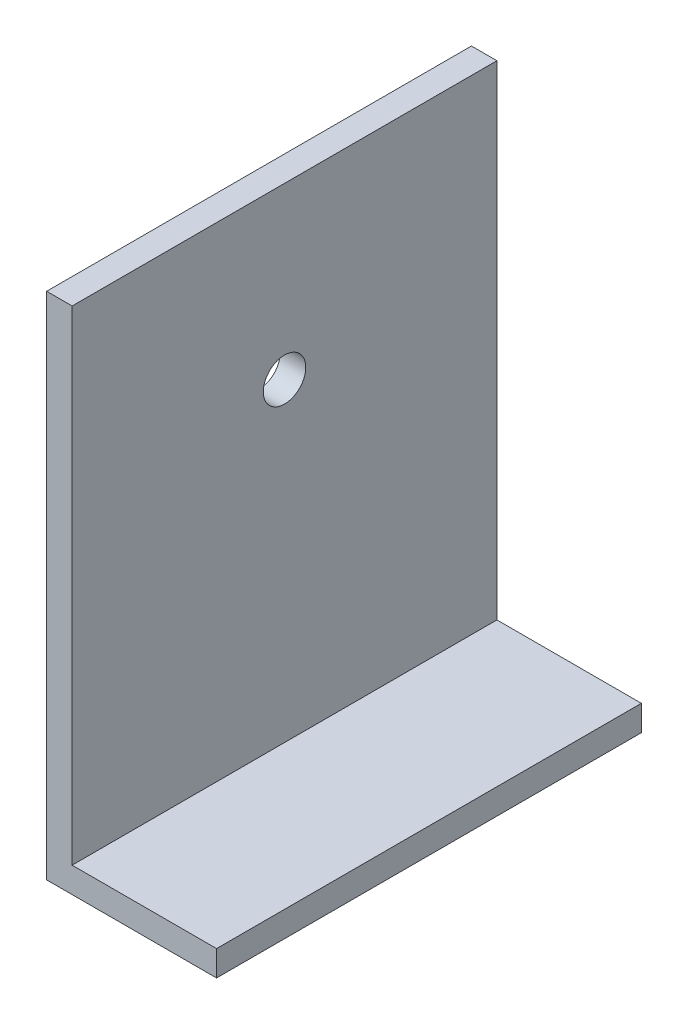
ISO-10303-21;
HEADER;
FILE_DESCRIPTION(('STEP AP214'),'2;1');
FILE_NAME('part.step','',(''),(''),'','','');
FILE_SCHEMA(('AUTOMOTIVE_DESIGN { 1 0 10303 214 1 1 1 1 }'));
ENDSEC;
DATA;
#1=APPLICATION_CONTEXT('core data for automotive mechanical design processes');
#2=APPLICATION_PROTOCOL_DEFINITION('international standard','automotive_design',2000,#1);
#3=PRODUCT_CONTEXT('',#1,'mechanical');
#4=PRODUCT('Part','Part','',(#3));
#5=PRODUCT_RELATED_PRODUCT_CATEGORY('part','',(#4));
#6=PRODUCT_DEFINITION_FORMATION('','',#4);
#7=PRODUCT_DEFINITION_CONTEXT('part definition',#1,'design');
#8=PRODUCT_DEFINITION('design','',#6,#7);
#9=PRODUCT_DEFINITION_SHAPE('','',#8);
#10=(LENGTH_UNIT() NAMED_UNIT(*) SI_UNIT(.MILLI.,.METRE.));
#11=(NAMED_UNIT(*) PLANE_ANGLE_UNIT() SI_UNIT($,.RADIAN.));
#12=(NAMED_UNIT(*) SI_UNIT($,.STERADIAN.) SOLID_ANGLE_UNIT());
#13=UNCERTAINTY_MEASURE_WITH_UNIT(LENGTH_MEASURE(1.E-05),#10,'distance_accuracy_value','');
#14=(GEOMETRIC_REPRESENTATION_CONTEXT(3) GLOBAL_UNCERTAINTY_ASSIGNED_CONTEXT((#13)) GLOBAL_UNIT_ASSIGNED_CONTEXT((#10,
#11,#12)) REPRESENTATION_CONTEXT('',''));
#15=CARTESIAN_POINT('',(0.,0.,0.));
#16=DIRECTION('',(0.,0.,1.));
#17=DIRECTION('',(1.,0.,0.));
#18=AXIS2_PLACEMENT_3D('',#15,#16,#17);
#19=CARTESIAN_POINT('',(0.,0.,50.));
#20=DIRECTION('',(1.,0.,0.));
#21=DIRECTION('',(0.,0.,-1.));
#22=AXIS2_PLACEMENT_3D('',#19,#20,#21);
#23=PLANE('',#22);
#24=CARTESIAN_POINT('',(0.,40.,25.));
#25=DIRECTION('',(-1.,0.,0.));
#26=DIRECTION('',(0.,0.,1.));
#27=AXIS2_PLACEMENT_3D('',#24,#25,#26);
#28=CIRCLE('',#27,2.5);
#29=CARTESIAN_POINT('',(0.,40.,27.5));
#30=VERTEX_POINT('',#29);
#31=EDGE_CURVE('E163',#30,#30,#28,.T.);
#32=ORIENTED_EDGE('',*,*,#31,.F.);
#33=EDGE_LOOP('',(#32));
#34=FACE_BOUND('',#33,.T.);
#35=DIRECTION('',(0.,-1.,0.));
#36=VECTOR('',#35,1.);
#37=CARTESIAN_POINT('',(0.,0.,0.));
#38=LINE('',#37,#36);
#39=CARTESIAN_POINT('',(0.,60.,0.));
#40=VERTEX_POINT('',#39);
#41=CARTESIAN_POINT('',(0.,0.,0.));
#42=VERTEX_POINT('',#41);
#43=EDGE_CURVE('E118',#40,#42,#38,.T.);
#44=ORIENTED_EDGE('',*,*,#43,.T.);
#45=DIRECTION('',(0.,0.,-1.));
#46=VECTOR('',#45,1.);
#47=CARTESIAN_POINT('',(0.,0.,50.));
#48=LINE('',#47,#46);
#49=CARTESIAN_POINT('',(0.,0.,50.));
#50=VERTEX_POINT('',#49);
#51=EDGE_CURVE('E11',#50,#42,#48,.T.);
#52=ORIENTED_EDGE('',*,*,#51,.F.);
#53=DIRECTION('',(0.,-1.,0.));
#54=VECTOR('',#53,1.);
#55=CARTESIAN_POINT('',(0.,0.,50.));
#56=LINE('',#55,#54);
#57=CARTESIAN_POINT('',(0.,60.,50.));
#58=VERTEX_POINT('',#57);
#59=EDGE_CURVE('E128',#58,#50,#56,.T.);
#60=ORIENTED_EDGE('',*,*,#59,.F.);
#61=DIRECTION('',(0.,0.,-1.));
#62=VECTOR('',#61,1.);
#63=CARTESIAN_POINT('',(0.,60.,50.));
#64=LINE('',#63,#62);
#65=EDGE_CURVE('E114',#58,#40,#64,.T.);
#66=ORIENTED_EDGE('',*,*,#65,.T.);
#67=EDGE_LOOP('',(#44,#52,#60,#66));
#68=FACE_BOUND('',#67,.T.);
#69=ADVANCED_FACE('F33',(#34,#68),#23,.F.);
#70=CARTESIAN_POINT('',(0.,0.,50.));
#71=DIRECTION('',(0.,1.,0.));
#72=DIRECTION('',(0.,0.,1.));
#73=AXIS2_PLACEMENT_3D('',#70,#71,#72);
#74=PLANE('',#73);
#75=DIRECTION('',(1.,0.,0.));
#76=VECTOR('',#75,1.);
#77=CARTESIAN_POINT('',(0.,0.,0.));
#78=LINE('',#77,#76);
#79=CARTESIAN_POINT('',(20.,0.,0.));
#80=VERTEX_POINT('',#79);
#81=EDGE_CURVE('E121',#42,#80,#78,.T.);
#82=ORIENTED_EDGE('',*,*,#81,.T.);
#83=DIRECTION('',(0.,0.,-1.));
#84=VECTOR('',#83,1.);
#85=CARTESIAN_POINT('',(20.,0.,50.));
#86=LINE('',#85,#84);
#87=CARTESIAN_POINT('',(20.,0.,50.));
#88=VERTEX_POINT('',#87);
#89=EDGE_CURVE('E42',#88,#80,#86,.T.);
#90=ORIENTED_EDGE('',*,*,#89,.F.);
#91=DIRECTION('',(1.,0.,0.));
#92=VECTOR('',#91,1.);
#93=CARTESIAN_POINT('',(0.,0.,50.));
#94=LINE('',#93,#92);
#95=EDGE_CURVE('E87',#50,#88,#94,.T.);
#96=ORIENTED_EDGE('',*,*,#95,.F.);
#97=ORIENTED_EDGE('',*,*,#51,.T.);
#98=EDGE_LOOP('',(#82,#90,#96,#97));
#99=FACE_BOUND('',#98,.T.);
#100=ADVANCED_FACE('F155',(#99),#74,.F.);
#101=CARTESIAN_POINT('',(20.,0.,50.));
#102=DIRECTION('',(-1.,0.,0.));
#103=DIRECTION('',(0.,-1.,0.));
#104=AXIS2_PLACEMENT_3D('',#101,#102,#103);
#105=PLANE('',#104);
#106=DIRECTION('',(0.,1.,0.));
#107=VECTOR('',#106,1.);
#108=CARTESIAN_POINT('',(20.,0.,0.));
#109=LINE('',#108,#107);
#110=CARTESIAN_POINT('',(20.,3.,0.));
#111=VERTEX_POINT('',#110);
#112=EDGE_CURVE('E123',#80,#111,#109,.T.);
#113=ORIENTED_EDGE('',*,*,#112,.T.);
#114=DIRECTION('',(0.,0.,-1.));
#115=VECTOR('',#114,1.);
#116=CARTESIAN_POINT('',(20.,3.,50.));
#117=LINE('',#116,#115);
#118=CARTESIAN_POINT('',(20.,3.,50.));
#119=VERTEX_POINT('',#118);
#120=EDGE_CURVE('E109',#119,#111,#117,.T.);
#121=ORIENTED_EDGE('',*,*,#120,.F.);
#122=DIRECTION('',(0.,1.,0.));
#123=VECTOR('',#122,1.);
#124=CARTESIAN_POINT('',(20.,0.,50.));
#125=LINE('',#124,#123);
#126=EDGE_CURVE('E100',#88,#119,#125,.T.);
#127=ORIENTED_EDGE('',*,*,#126,.F.);
#128=ORIENTED_EDGE('',*,*,#89,.T.);
#129=EDGE_LOOP('',(#113,#121,#127,#128));
#130=FACE_BOUND('',#129,.T.);
#131=ADVANCED_FACE('F135',(#130),#105,.F.);
#132=CARTESIAN_POINT('',(20.,3.,50.));
#133=DIRECTION('',(0.,-1.,0.));
#134=DIRECTION('',(1.,0.,0.));
#135=AXIS2_PLACEMENT_3D('',#132,#133,#134);
#136=PLANE('',#135);
#137=DIRECTION('',(-1.,0.,0.));
#138=VECTOR('',#137,1.);
#139=CARTESIAN_POINT('',(20.,3.,0.));
#140=LINE('',#139,#138);
#141=CARTESIAN_POINT('',(3.00000000000001,3.,0.));
#142=VERTEX_POINT('',#141);
#143=EDGE_CURVE('E108',#111,#142,#140,.T.);
#144=ORIENTED_EDGE('',*,*,#143,.T.);
#145=DIRECTION('',(0.,0.,-1.));
#146=VECTOR('',#145,1.);
#147=CARTESIAN_POINT('',(3.00000000000001,3.,50.));
#148=LINE('',#147,#146);
#149=CARTESIAN_POINT('',(3.00000000000001,3.,50.));
#150=VERTEX_POINT('',#149);
#151=EDGE_CURVE('E105',#150,#142,#148,.T.);
#152=ORIENTED_EDGE('',*,*,#151,.F.);
#153=DIRECTION('',(-1.,0.,0.));
#154=VECTOR('',#153,1.);
#155=CARTESIAN_POINT('',(20.,3.,50.));
#156=LINE('',#155,#154);
#157=EDGE_CURVE('E94',#119,#150,#156,.T.);
#158=ORIENTED_EDGE('',*,*,#157,.F.);
#159=ORIENTED_EDGE('',*,*,#120,.T.);
#160=EDGE_LOOP('',(#144,#152,#158,#159));
#161=FACE_BOUND('',#160,.T.);
#162=ADVANCED_FACE('F106',(#161),#136,.F.);
#163=CARTESIAN_POINT('',(3.,60.,50.));
#164=DIRECTION('',(-1.,0.,0.));
#165=DIRECTION('',(0.,-1.,0.));
#166=AXIS2_PLACEMENT_3D('',#163,#164,#165);
#167=PLANE('',#166);
#168=CARTESIAN_POINT('',(3.00000000000001,40.,25.));
#169=DIRECTION('',(-1.,0.,0.));
#170=DIRECTION('',(0.,-1.,0.));
#171=AXIS2_PLACEMENT_3D('',#168,#169,#170);
#172=CIRCLE('',#171,2.5);
#173=CARTESIAN_POINT('',(3.00000000000001,37.5,25.));
#174=VERTEX_POINT('',#173);
#175=EDGE_CURVE('E36',#174,#174,#172,.T.);
#176=ORIENTED_EDGE('',*,*,#175,.T.);
#177=EDGE_LOOP('',(#176));
#178=FACE_BOUND('',#177,.T.);
#179=DIRECTION('',(0.,1.,0.));
#180=VECTOR('',#179,1.);
#181=CARTESIAN_POINT('',(3.,60.,0.));
#182=LINE('',#181,#180);
#183=CARTESIAN_POINT('',(3.,60.,0.));
#184=VERTEX_POINT('',#183);
#185=EDGE_CURVE('E73',#142,#184,#182,.T.);
#186=ORIENTED_EDGE('',*,*,#185,.T.);
#187=DIRECTION('',(0.,0.,-1.));
#188=VECTOR('',#187,1.);
#189=CARTESIAN_POINT('',(3.,60.,50.));
#190=LINE('',#189,#188);
#191=CARTESIAN_POINT('',(3.,60.,50.));
#192=VERTEX_POINT('',#191);
#193=EDGE_CURVE('E110',#192,#184,#190,.T.);
#194=ORIENTED_EDGE('',*,*,#193,.F.);
#195=DIRECTION('',(0.,1.,0.));
#196=VECTOR('',#195,1.);
#197=CARTESIAN_POINT('',(3.,60.,50.));
#198=LINE('',#197,#196);
#199=EDGE_CURVE('E98',#150,#192,#198,.T.);
#200=ORIENTED_EDGE('',*,*,#199,.F.);
#201=ORIENTED_EDGE('',*,*,#151,.T.);
#202=EDGE_LOOP('',(#186,#194,#200,#201));
#203=FACE_BOUND('',#202,.T.);
#204=ADVANCED_FACE('F112',(#178,#203),#167,.F.);
#205=CARTESIAN_POINT('',(0.,60.,50.));
#206=DIRECTION('',(0.,-1.,0.));
#207=DIRECTION('',(0.,0.,-1.));
#208=AXIS2_PLACEMENT_3D('',#205,#206,#207);
#209=PLANE('',#208);
#210=DIRECTION('',(-1.,0.,0.));
#211=VECTOR('',#210,1.);
#212=CARTESIAN_POINT('',(0.,60.,0.));
#213=LINE('',#212,#211);
#214=EDGE_CURVE('E79',#184,#40,#213,.T.);
#215=ORIENTED_EDGE('',*,*,#214,.T.);
#216=ORIENTED_EDGE('',*,*,#65,.F.);
#217=DIRECTION('',(-1.,0.,0.));
#218=VECTOR('',#217,1.);
#219=CARTESIAN_POINT('',(0.,60.,50.));
#220=LINE('',#219,#218);
#221=EDGE_CURVE('E50',#192,#58,#220,.T.);
#222=ORIENTED_EDGE('',*,*,#221,.F.);
#223=ORIENTED_EDGE('',*,*,#193,.T.);
#224=EDGE_LOOP('',(#215,#216,#222,#223));
#225=FACE_BOUND('',#224,.T.);
#226=ADVANCED_FACE('F142',(#225),#209,.F.);
#227=CARTESIAN_POINT('',(0.,0.,50.));
#228=DIRECTION('',(0.,0.,-1.));
#229=DIRECTION('',(-1.,0.,0.));
#230=AXIS2_PLACEMENT_3D('',#227,#228,#229);
#231=PLANE('',#230);
#232=ORIENTED_EDGE('',*,*,#59,.T.);
#233=ORIENTED_EDGE('',*,*,#95,.T.);
#234=ORIENTED_EDGE('',*,*,#126,.T.);
#235=ORIENTED_EDGE('',*,*,#157,.T.);
#236=ORIENTED_EDGE('',*,*,#199,.T.);
#237=ORIENTED_EDGE('',*,*,#221,.T.);
#238=EDGE_LOOP('',(#232,#233,#234,#235,#236,#237));
#239=FACE_BOUND('',#238,.T.);
#240=ADVANCED_FACE('F96',(#239),#231,.F.);
#241=CARTESIAN_POINT('',(0.,0.,0.));
#242=DIRECTION('',(0.,0.,-1.));
#243=DIRECTION('',(-1.,0.,0.));
#244=AXIS2_PLACEMENT_3D('',#241,#242,#243);
#245=PLANE('',#244);
#246=ORIENTED_EDGE('',*,*,#43,.F.);
#247=ORIENTED_EDGE('',*,*,#214,.F.);
#248=ORIENTED_EDGE('',*,*,#185,.F.);
#249=ORIENTED_EDGE('',*,*,#143,.F.);
#250=ORIENTED_EDGE('',*,*,#112,.F.);
#251=ORIENTED_EDGE('',*,*,#81,.F.);
#252=EDGE_LOOP('',(#246,#247,#248,#249,#250,#251));
#253=FACE_BOUND('',#252,.T.);
#254=ADVANCED_FACE('F138',(#253),#245,.T.);
#255=CARTESIAN_POINT('',(20.,40.,25.));
#256=DIRECTION('',(-1.,0.,0.));
#257=DIRECTION('',(0.,0.,1.));
#258=AXIS2_PLACEMENT_3D('',#255,#256,#257);
#259=CYLINDRICAL_SURFACE('',#258,2.5);
#260=ORIENTED_EDGE('',*,*,#31,.T.);
#261=EDGE_LOOP('',(#260));
#262=FACE_BOUND('',#261,.T.);
#263=ORIENTED_EDGE('',*,*,#175,.F.);
#264=EDGE_LOOP('',(#263));
#265=FACE_BOUND('',#264,.T.);
#266=ADVANCED_FACE('F171',(#262,#265),#259,.F.);
#267=CLOSED_SHELL('',(#69,#100,#131,#162,#204,#226,#240,#254,#266));
#268=MANIFOLD_SOLID_BREP('B2',#267);
#269=ADVANCED_BREP_SHAPE_REPRESENTATION('',(#18,#268),#14);
#270=SHAPE_DEFINITION_REPRESENTATION(#9,#269);
ENDSEC;
END-ISO-10303-21;
